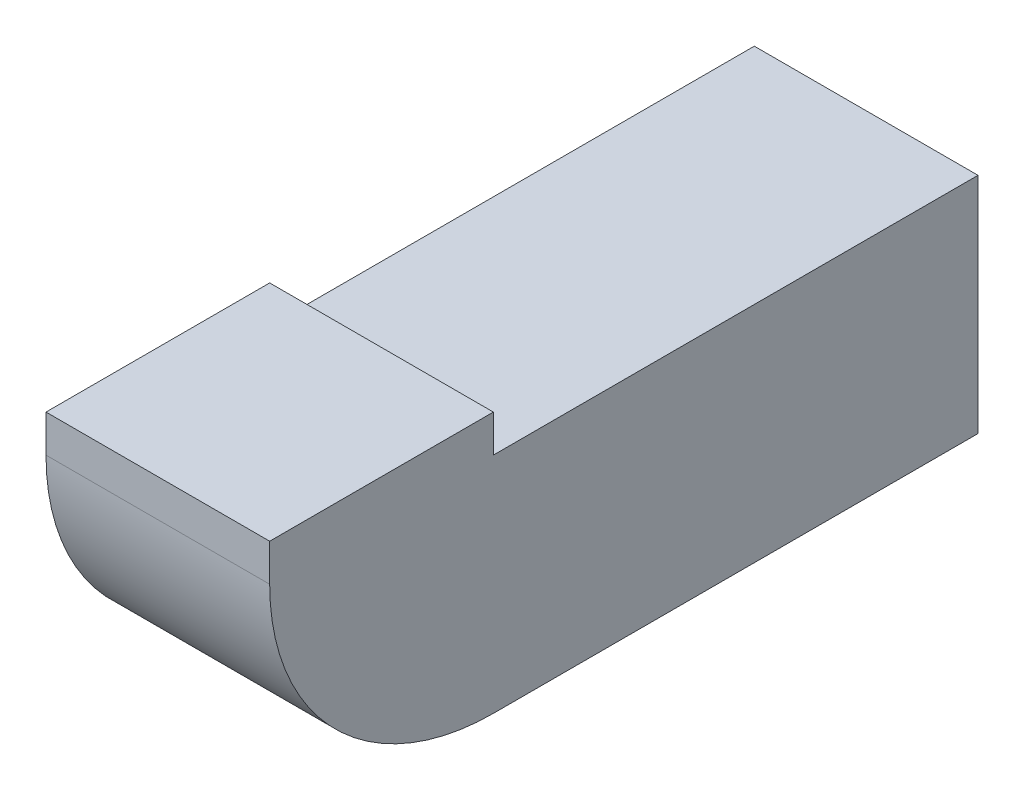
ISO-10303-21;
HEADER;
FILE_DESCRIPTION(('STEP AP214'),'2;1');
FILE_NAME('part.step','',(''),(''),'','','');
FILE_SCHEMA(('AUTOMOTIVE_DESIGN { 1 0 10303 214 1 1 1 1 }'));
ENDSEC;
DATA;
#1=APPLICATION_CONTEXT('core data for automotive mechanical design processes');
#2=APPLICATION_PROTOCOL_DEFINITION('international standard','automotive_design',2000,#1);
#3=PRODUCT_CONTEXT('',#1,'mechanical');
#4=PRODUCT('Part','Part','',(#3));
#5=PRODUCT_RELATED_PRODUCT_CATEGORY('part','',(#4));
#6=PRODUCT_DEFINITION_FORMATION('','',#4);
#7=PRODUCT_DEFINITION_CONTEXT('part definition',#1,'design');
#8=PRODUCT_DEFINITION('design','',#6,#7);
#9=PRODUCT_DEFINITION_SHAPE('','',#8);
#10=(LENGTH_UNIT() NAMED_UNIT(*) SI_UNIT(.MILLI.,.METRE.));
#11=(NAMED_UNIT(*) PLANE_ANGLE_UNIT() SI_UNIT($,.RADIAN.));
#12=(NAMED_UNIT(*) SI_UNIT($,.STERADIAN.) SOLID_ANGLE_UNIT());
#13=UNCERTAINTY_MEASURE_WITH_UNIT(LENGTH_MEASURE(1.E-05),#10,'distance_accuracy_value','');
#14=(GEOMETRIC_REPRESENTATION_CONTEXT(3) GLOBAL_UNCERTAINTY_ASSIGNED_CONTEXT((#13)) GLOBAL_UNIT_ASSIGNED_CONTEXT((#10,
#11,#12)) REPRESENTATION_CONTEXT('',''));
#15=CARTESIAN_POINT('',(0.,0.,0.));
#16=DIRECTION('',(0.,0.,1.));
#17=DIRECTION('',(1.,0.,0.));
#18=AXIS2_PLACEMENT_3D('',#15,#16,#17);
#19=CARTESIAN_POINT('',(-0.300000000000001,-0.199999999999999,0.850000000000001));
#20=DIRECTION('',(1.,0.,0.));
#21=DIRECTION('',(0.,1.,0.));
#22=AXIS2_PLACEMENT_3D('',#19,#20,#21);
#23=PLANE('',#22);
#24=DIRECTION('',(0.,0.,1.));
#25=VECTOR('',#24,1.);
#26=CARTESIAN_POINT('',(-0.300000000000001,-0.199999999999999,0.));
#27=LINE('',#26,#25);
#28=CARTESIAN_POINT('',(-0.300000000000001,-0.199999999999999,0.250000000000001));
#29=VERTEX_POINT('',#28);
#30=CARTESIAN_POINT('',(-0.300000000000001,-0.199999999999999,-1.05));
#31=VERTEX_POINT('',#30);
#32=EDGE_CURVE('E81',#29,#31,#27,.F.);
#33=ORIENTED_EDGE('',*,*,#32,.F.);
#34=CARTESIAN_POINT('',(-0.300000000000001,0.400000000000001,0.250000000000001));
#35=DIRECTION('',(1.,0.,0.));
#36=DIRECTION('',(0.,0.,-1.));
#37=AXIS2_PLACEMENT_3D('',#34,#35,#36);
#38=CIRCLE('',#37,0.6);
#39=CARTESIAN_POINT('',(-0.300000000000001,0.400000000000001,0.850000000000001));
#40=VERTEX_POINT('',#39);
#41=EDGE_CURVE('E20',#40,#29,#38,.T.);
#42=ORIENTED_EDGE('',*,*,#41,.F.);
#43=DIRECTION('',(0.,1.,0.));
#44=VECTOR('',#43,1.);
#45=CARTESIAN_POINT('',(-0.300000000000001,-0.199999999999999,0.850000000000001));
#46=LINE('',#45,#44);
#47=CARTESIAN_POINT('',(-0.300000000000001,0.500000000000001,0.850000000000001));
#48=VERTEX_POINT('',#47);
#49=EDGE_CURVE('E93',#40,#48,#46,.T.);
#50=ORIENTED_EDGE('',*,*,#49,.T.);
#51=DIRECTION('',(0.,0.,1.));
#52=VECTOR('',#51,1.);
#53=CARTESIAN_POINT('',(-0.300000000000001,0.500000000000001,0.));
#54=LINE('',#53,#52);
#55=CARTESIAN_POINT('',(-0.300000000000001,0.500000000000001,0.250000000000001));
#56=VERTEX_POINT('',#55);
#57=EDGE_CURVE('E112',#48,#56,#54,.F.);
#58=ORIENTED_EDGE('',*,*,#57,.T.);
#59=DIRECTION('',(0.,1.,0.));
#60=VECTOR('',#59,1.);
#61=CARTESIAN_POINT('',(-0.300000000000001,-0.199999999999999,0.250000000000001));
#62=LINE('',#61,#60);
#63=CARTESIAN_POINT('',(-0.300000000000001,0.4,0.250000000000001));
#64=VERTEX_POINT('',#63);
#65=EDGE_CURVE('E139',#56,#64,#62,.F.);
#66=ORIENTED_EDGE('',*,*,#65,.T.);
#67=DIRECTION('',(0.,0.,-1.));
#68=VECTOR('',#67,1.);
#69=CARTESIAN_POINT('',(-0.300000000000001,0.4,-5.55));
#70=LINE('',#69,#68);
#71=CARTESIAN_POINT('',(-0.300000000000001,0.4,-1.05));
#72=VERTEX_POINT('',#71);
#73=EDGE_CURVE('E101',#64,#72,#70,.T.);
#74=ORIENTED_EDGE('',*,*,#73,.T.);
#75=DIRECTION('',(0.,1.,0.));
#76=VECTOR('',#75,1.);
#77=CARTESIAN_POINT('',(-0.300000000000001,-0.199999999999999,-1.05));
#78=LINE('',#77,#76);
#79=EDGE_CURVE('E84',#31,#72,#78,.T.);
#80=ORIENTED_EDGE('',*,*,#79,.F.);
#81=EDGE_LOOP('',(#33,#42,#50,#58,#66,#74,#80));
#82=FACE_BOUND('',#81,.T.);
#83=ADVANCED_FACE('F17',(#82),#23,.F.);
#84=CARTESIAN_POINT('',(0.,-0.199999999999999,0.));
#85=DIRECTION('',(0.,-1.,0.));
#86=DIRECTION('',(1.,0.,0.));
#87=AXIS2_PLACEMENT_3D('',#84,#85,#86);
#88=PLANE('',#87);
#89=DIRECTION('',(1.,0.,0.));
#90=VECTOR('',#89,1.);
#91=CARTESIAN_POINT('',(0.,-0.199999999999999,0.250000000000001));
#92=LINE('',#91,#90);
#93=CARTESIAN_POINT('',(0.299999999999999,-0.199999999999999,0.250000000000001));
#94=VERTEX_POINT('',#93);
#95=EDGE_CURVE('E78',#29,#94,#92,.T.);
#96=ORIENTED_EDGE('',*,*,#95,.F.);
#97=ORIENTED_EDGE('',*,*,#32,.T.);
#98=DIRECTION('',(1.,0.,0.));
#99=VECTOR('',#98,1.);
#100=CARTESIAN_POINT('',(1.5,-0.199999999999999,-1.05));
#101=LINE('',#100,#99);
#102=CARTESIAN_POINT('',(0.299999999999999,-0.199999999999999,-1.05));
#103=VERTEX_POINT('',#102);
#104=EDGE_CURVE('E99',#31,#103,#101,.T.);
#105=ORIENTED_EDGE('',*,*,#104,.T.);
#106=DIRECTION('',(0.,0.,1.));
#107=VECTOR('',#106,1.);
#108=CARTESIAN_POINT('',(0.299999999999999,-0.199999999999999,0.250000000000001));
#109=LINE('',#108,#107);
#110=EDGE_CURVE('E91',#103,#94,#109,.T.);
#111=ORIENTED_EDGE('',*,*,#110,.T.);
#112=EDGE_LOOP('',(#96,#97,#105,#111));
#113=FACE_BOUND('',#112,.T.);
#114=ADVANCED_FACE('F90',(#113),#88,.T.);
#115=CARTESIAN_POINT('',(0.,0.400000000000001,0.250000000000001));
#116=DIRECTION('',(1.,0.,0.));
#117=DIRECTION('',(0.,0.,-1.));
#118=AXIS2_PLACEMENT_3D('',#115,#116,#117);
#119=CYLINDRICAL_SURFACE('',#118,0.6);
#120=ORIENTED_EDGE('',*,*,#41,.T.);
#121=ORIENTED_EDGE('',*,*,#95,.T.);
#122=CARTESIAN_POINT('',(0.299999999999999,0.400000000000001,0.250000000000001));
#123=DIRECTION('',(1.,0.,0.));
#124=DIRECTION('',(0.,0.,-1.));
#125=AXIS2_PLACEMENT_3D('',#122,#123,#124);
#126=CIRCLE('',#125,0.6);
#127=CARTESIAN_POINT('',(0.299999999999999,0.400000000000001,0.850000000000001));
#128=VERTEX_POINT('',#127);
#129=EDGE_CURVE('E126',#94,#128,#126,.F.);
#130=ORIENTED_EDGE('',*,*,#129,.T.);
#131=DIRECTION('',(-1.,0.,0.));
#132=VECTOR('',#131,1.);
#133=CARTESIAN_POINT('',(0.299999999999999,0.400000000000001,0.850000000000001));
#134=LINE('',#133,#132);
#135=EDGE_CURVE('E80',#128,#40,#134,.T.);
#136=ORIENTED_EDGE('',*,*,#135,.T.);
#137=EDGE_LOOP('',(#120,#121,#130,#136));
#138=FACE_BOUND('',#137,.T.);
#139=ADVANCED_FACE('F75',(#138),#119,.T.);
#140=CARTESIAN_POINT('',(0.299999999999999,-0.199999999999999,0.850000000000001));
#141=DIRECTION('',(0.,0.,-1.));
#142=DIRECTION('',(-1.,0.,0.));
#143=AXIS2_PLACEMENT_3D('',#140,#141,#142);
#144=PLANE('',#143);
#145=ORIENTED_EDGE('',*,*,#135,.F.);
#146=DIRECTION('',(0.,-1.,0.));
#147=VECTOR('',#146,1.);
#148=CARTESIAN_POINT('',(0.299999999999999,-0.199999999999999,0.850000000000001));
#149=LINE('',#148,#147);
#150=CARTESIAN_POINT('',(0.299999999999999,0.500000000000001,0.850000000000001));
#151=VERTEX_POINT('',#150);
#152=EDGE_CURVE('E127',#128,#151,#149,.F.);
#153=ORIENTED_EDGE('',*,*,#152,.T.);
#154=DIRECTION('',(1.,0.,0.));
#155=VECTOR('',#154,1.);
#156=CARTESIAN_POINT('',(0.,0.500000000000001,0.850000000000001));
#157=LINE('',#156,#155);
#158=EDGE_CURVE('E109',#151,#48,#157,.F.);
#159=ORIENTED_EDGE('',*,*,#158,.T.);
#160=ORIENTED_EDGE('',*,*,#49,.F.);
#161=EDGE_LOOP('',(#145,#153,#159,#160));
#162=FACE_BOUND('',#161,.T.);
#163=ADVANCED_FACE('F149',(#162),#144,.F.);
#164=CARTESIAN_POINT('',(0.,0.500000000000001,0.));
#165=DIRECTION('',(0.,-1.,0.));
#166=DIRECTION('',(1.,0.,0.));
#167=AXIS2_PLACEMENT_3D('',#164,#165,#166);
#168=PLANE('',#167);
#169=ORIENTED_EDGE('',*,*,#57,.F.);
#170=ORIENTED_EDGE('',*,*,#158,.F.);
#171=DIRECTION('',(0.,0.,1.));
#172=VECTOR('',#171,1.);
#173=CARTESIAN_POINT('',(0.299999999999999,0.500000000000001,0.250000000000001));
#174=LINE('',#173,#172);
#175=CARTESIAN_POINT('',(0.299999999999999,0.500000000000001,0.250000000000001));
#176=VERTEX_POINT('',#175);
#177=EDGE_CURVE('E129',#151,#176,#174,.F.);
#178=ORIENTED_EDGE('',*,*,#177,.T.);
#179=DIRECTION('',(1.,0.,0.));
#180=VECTOR('',#179,1.);
#181=CARTESIAN_POINT('',(-0.300000000000001,0.500000000000001,0.250000000000001));
#182=LINE('',#181,#180);
#183=EDGE_CURVE('E114',#176,#56,#182,.F.);
#184=ORIENTED_EDGE('',*,*,#183,.T.);
#185=EDGE_LOOP('',(#169,#170,#178,#184));
#186=FACE_BOUND('',#185,.T.);
#187=ADVANCED_FACE('F154',(#186),#168,.F.);
#188=CARTESIAN_POINT('',(-0.300000000000001,-0.199999999999999,0.250000000000001));
#189=DIRECTION('',(0.,0.,1.));
#190=DIRECTION('',(1.,0.,0.));
#191=AXIS2_PLACEMENT_3D('',#188,#189,#190);
#192=PLANE('',#191);
#193=ORIENTED_EDGE('',*,*,#65,.F.);
#194=ORIENTED_EDGE('',*,*,#183,.F.);
#195=DIRECTION('',(0.,-1.,0.));
#196=VECTOR('',#195,1.);
#197=CARTESIAN_POINT('',(0.299999999999999,-0.199999999999999,0.250000000000001));
#198=LINE('',#197,#196);
#199=CARTESIAN_POINT('',(0.299999999999999,0.4,0.250000000000001));
#200=VERTEX_POINT('',#199);
#201=EDGE_CURVE('E145',#176,#200,#198,.T.);
#202=ORIENTED_EDGE('',*,*,#201,.T.);
#203=DIRECTION('',(1.,0.,0.));
#204=VECTOR('',#203,1.);
#205=CARTESIAN_POINT('',(0.299999999999999,0.4,0.250000000000001));
#206=LINE('',#205,#204);
#207=EDGE_CURVE('E121',#200,#64,#206,.F.);
#208=ORIENTED_EDGE('',*,*,#207,.T.);
#209=EDGE_LOOP('',(#193,#194,#202,#208));
#210=FACE_BOUND('',#209,.T.);
#211=ADVANCED_FACE('F168',(#210),#192,.F.);
#212=CARTESIAN_POINT('',(0.299999999999999,0.4,-5.55));
#213=DIRECTION('',(0.,-1.,0.));
#214=DIRECTION('',(0.,0.,-1.));
#215=AXIS2_PLACEMENT_3D('',#212,#213,#214);
#216=PLANE('',#215);
#217=ORIENTED_EDGE('',*,*,#73,.F.);
#218=ORIENTED_EDGE('',*,*,#207,.F.);
#219=DIRECTION('',(0.,0.,1.));
#220=VECTOR('',#219,1.);
#221=CARTESIAN_POINT('',(0.299999999999999,0.4,0.250000000000001));
#222=LINE('',#221,#220);
#223=CARTESIAN_POINT('',(0.299999999999999,0.4,-1.05));
#224=VERTEX_POINT('',#223);
#225=EDGE_CURVE('E26',#200,#224,#222,.F.);
#226=ORIENTED_EDGE('',*,*,#225,.T.);
#227=DIRECTION('',(1.,0.,0.));
#228=VECTOR('',#227,1.);
#229=CARTESIAN_POINT('',(1.5,0.4,-1.05));
#230=LINE('',#229,#228);
#231=EDGE_CURVE('E34',#224,#72,#230,.F.);
#232=ORIENTED_EDGE('',*,*,#231,.T.);
#233=EDGE_LOOP('',(#217,#218,#226,#232));
#234=FACE_BOUND('',#233,.T.);
#235=ADVANCED_FACE('F166',(#234),#216,.F.);
#236=CARTESIAN_POINT('',(1.5,0.25,-1.05));
#237=DIRECTION('',(0.,0.,1.));
#238=DIRECTION('',(1.,0.,0.));
#239=AXIS2_PLACEMENT_3D('',#236,#237,#238);
#240=PLANE('',#239);
#241=ORIENTED_EDGE('',*,*,#231,.F.);
#242=DIRECTION('',(0.,-1.,0.));
#243=VECTOR('',#242,1.);
#244=CARTESIAN_POINT('',(0.299999999999999,-0.199999999999999,-1.05));
#245=LINE('',#244,#243);
#246=EDGE_CURVE('E11',#224,#103,#245,.T.);
#247=ORIENTED_EDGE('',*,*,#246,.T.);
#248=ORIENTED_EDGE('',*,*,#104,.F.);
#249=ORIENTED_EDGE('',*,*,#79,.T.);
#250=EDGE_LOOP('',(#241,#247,#248,#249));
#251=FACE_BOUND('',#250,.T.);
#252=ADVANCED_FACE('F176',(#251),#240,.F.);
#253=CARTESIAN_POINT('',(0.299999999999999,-0.199999999999999,0.250000000000001));
#254=DIRECTION('',(-1.,0.,0.));
#255=DIRECTION('',(0.,-1.,0.));
#256=AXIS2_PLACEMENT_3D('',#253,#254,#255);
#257=PLANE('',#256);
#258=ORIENTED_EDGE('',*,*,#225,.F.);
#259=ORIENTED_EDGE('',*,*,#201,.F.);
#260=ORIENTED_EDGE('',*,*,#177,.F.);
#261=ORIENTED_EDGE('',*,*,#152,.F.);
#262=ORIENTED_EDGE('',*,*,#129,.F.);
#263=ORIENTED_EDGE('',*,*,#110,.F.);
#264=ORIENTED_EDGE('',*,*,#246,.F.);
#265=EDGE_LOOP('',(#258,#259,#260,#261,#262,#263,#264));
#266=FACE_BOUND('',#265,.T.);
#267=ADVANCED_FACE('F158',(#266),#257,.F.);
#268=CLOSED_SHELL('',(#83,#114,#139,#163,#187,#211,#235,#252,#267));
#269=MANIFOLD_SOLID_BREP('B1',#268);
#270=ADVANCED_BREP_SHAPE_REPRESENTATION('',(#18,#269),#14);
#271=SHAPE_DEFINITION_REPRESENTATION(#9,#270);
ENDSEC;
END-ISO-10303-21;
